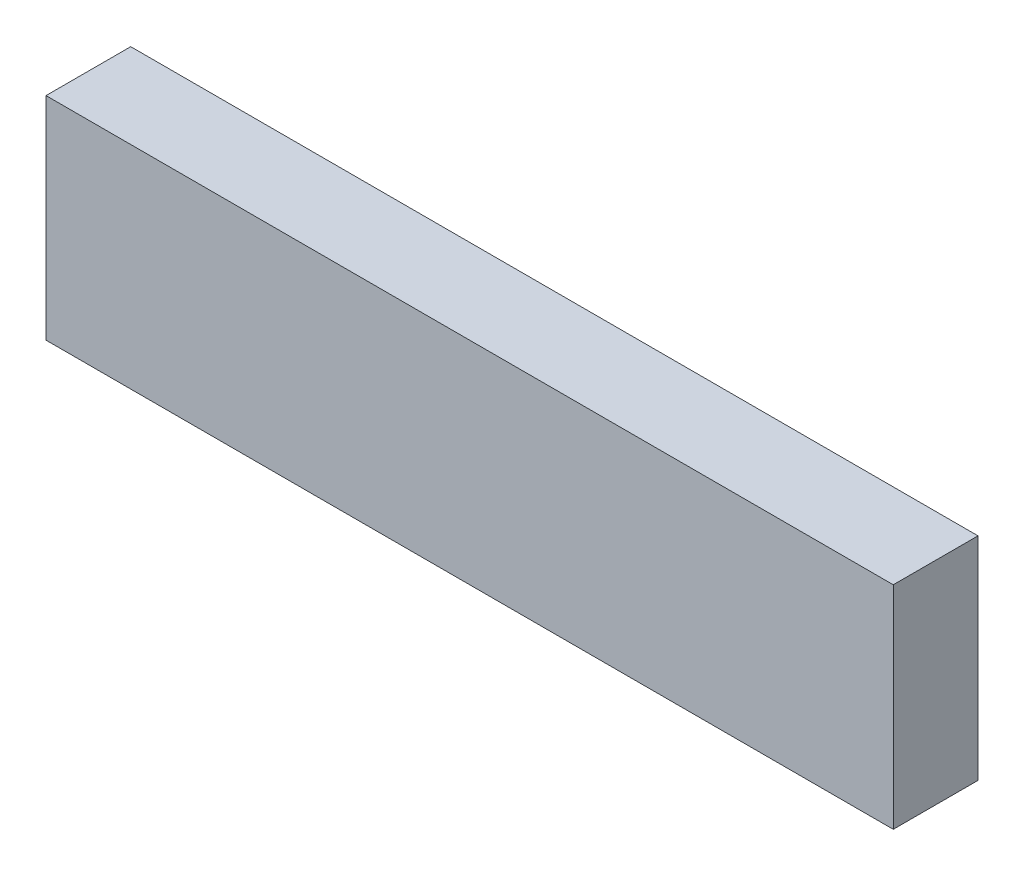
ISO-10303-21;
HEADER;
FILE_DESCRIPTION(('STEP AP214'),'2;1');
FILE_NAME('part.step','',(''),(''),'','','');
FILE_SCHEMA(('AUTOMOTIVE_DESIGN { 1 0 10303 214 1 1 1 1 }'));
ENDSEC;
DATA;
#1=APPLICATION_CONTEXT('core data for automotive mechanical design processes');
#2=APPLICATION_PROTOCOL_DEFINITION('international standard','automotive_design',2000,#1);
#3=PRODUCT_CONTEXT('',#1,'mechanical');
#4=PRODUCT('Part','Part','',(#3));
#5=PRODUCT_RELATED_PRODUCT_CATEGORY('part','',(#4));
#6=PRODUCT_DEFINITION_FORMATION('','',#4);
#7=PRODUCT_DEFINITION_CONTEXT('part definition',#1,'design');
#8=PRODUCT_DEFINITION('design','',#6,#7);
#9=PRODUCT_DEFINITION_SHAPE('','',#8);
#10=(LENGTH_UNIT() NAMED_UNIT(*) SI_UNIT(.MILLI.,.METRE.));
#11=(NAMED_UNIT(*) PLANE_ANGLE_UNIT() SI_UNIT($,.RADIAN.));
#12=(NAMED_UNIT(*) SI_UNIT($,.STERADIAN.) SOLID_ANGLE_UNIT());
#13=UNCERTAINTY_MEASURE_WITH_UNIT(LENGTH_MEASURE(1.E-05),#10,'distance_accuracy_value','');
#14=(GEOMETRIC_REPRESENTATION_CONTEXT(3) GLOBAL_UNCERTAINTY_ASSIGNED_CONTEXT((#13)) GLOBAL_UNIT_ASSIGNED_CONTEXT((#10,
#11,#12)) REPRESENTATION_CONTEXT('',''));
#15=CARTESIAN_POINT('',(0.,0.,0.));
#16=DIRECTION('',(0.,0.,1.));
#17=DIRECTION('',(1.,0.,0.));
#18=AXIS2_PLACEMENT_3D('',#15,#16,#17);
#19=CARTESIAN_POINT('',(198.,46.99,55.8));
#20=DIRECTION('',(0.,0.,-1.));
#21=DIRECTION('',(-1.,0.,0.));
#22=AXIS2_PLACEMENT_3D('',#19,#20,#21);
#23=PLANE('',#22);
#24=DIRECTION('',(0.,1.,0.));
#25=VECTOR('',#24,1.);
#26=CARTESIAN_POINT('',(210.,46.99,55.8));
#27=LINE('',#26,#25);
#28=CARTESIAN_POINT('',(210.,47.,55.8));
#29=VERTEX_POINT('',#28);
#30=CARTESIAN_POINT('',(210.,50.,55.8));
#31=VERTEX_POINT('',#30);
#32=EDGE_CURVE('E11',#29,#31,#27,.T.);
#33=ORIENTED_EDGE('',*,*,#32,.F.);
#34=DIRECTION('',(-1.,0.,0.));
#35=VECTOR('',#34,1.);
#36=CARTESIAN_POINT('',(300.,47.,55.8));
#37=LINE('',#36,#35);
#38=CARTESIAN_POINT('',(198.,47.,55.8));
#39=VERTEX_POINT('',#38);
#40=EDGE_CURVE('E39',#29,#39,#37,.T.);
#41=ORIENTED_EDGE('',*,*,#40,.T.);
#42=DIRECTION('',(0.,1.,0.));
#43=VECTOR('',#42,1.);
#44=CARTESIAN_POINT('',(198.,46.99,55.8));
#45=LINE('',#44,#43);
#46=CARTESIAN_POINT('',(198.,50.,55.8));
#47=VERTEX_POINT('',#46);
#48=EDGE_CURVE('E44',#39,#47,#45,.T.);
#49=ORIENTED_EDGE('',*,*,#48,.T.);
#50=DIRECTION('',(1.,0.,0.));
#51=VECTOR('',#50,1.);
#52=CARTESIAN_POINT('',(-300.,50.,55.8));
#53=LINE('',#52,#51);
#54=EDGE_CURVE('E94',#47,#31,#53,.T.);
#55=ORIENTED_EDGE('',*,*,#54,.T.);
#56=EDGE_LOOP('',(#33,#41,#49,#55));
#57=FACE_BOUND('',#56,.T.);
#58=ADVANCED_FACE('F35',(#57),#23,.T.);
#59=CARTESIAN_POINT('',(210.,46.99,55.8));
#60=DIRECTION('',(1.,0.,0.));
#61=DIRECTION('',(0.,0.,-1.));
#62=AXIS2_PLACEMENT_3D('',#59,#60,#61);
#63=PLANE('',#62);
#64=DIRECTION('',(0.,1.,0.));
#65=VECTOR('',#64,1.);
#66=CARTESIAN_POINT('',(210.,46.99,57.));
#67=LINE('',#66,#65);
#68=CARTESIAN_POINT('',(210.,47.,57.));
#69=VERTEX_POINT('',#68);
#70=CARTESIAN_POINT('',(210.,50.,57.));
#71=VERTEX_POINT('',#70);
#72=EDGE_CURVE('E83',#69,#71,#67,.T.);
#73=ORIENTED_EDGE('',*,*,#72,.F.);
#74=DIRECTION('',(0.,0.,-1.));
#75=VECTOR('',#74,1.);
#76=CARTESIAN_POINT('',(210.,47.,3.));
#77=LINE('',#76,#75);
#78=EDGE_CURVE('E102',#69,#29,#77,.T.);
#79=ORIENTED_EDGE('',*,*,#78,.T.);
#80=ORIENTED_EDGE('',*,*,#32,.T.);
#81=DIRECTION('',(0.,0.,1.));
#82=VECTOR('',#81,1.);
#83=CARTESIAN_POINT('',(210.,50.,60.));
#84=LINE('',#83,#82);
#85=EDGE_CURVE('E91',#31,#71,#84,.T.);
#86=ORIENTED_EDGE('',*,*,#85,.T.);
#87=EDGE_LOOP('',(#73,#79,#80,#86));
#88=FACE_BOUND('',#87,.T.);
#89=ADVANCED_FACE('F114',(#88),#63,.T.);
#90=CARTESIAN_POINT('',(198.,46.99,55.8));
#91=DIRECTION('',(-1.,0.,0.));
#92=DIRECTION('',(0.,0.,1.));
#93=AXIS2_PLACEMENT_3D('',#90,#91,#92);
#94=PLANE('',#93);
#95=ORIENTED_EDGE('',*,*,#48,.F.);
#96=DIRECTION('',(0.,0.,1.));
#97=VECTOR('',#96,1.);
#98=CARTESIAN_POINT('',(198.,47.,3.));
#99=LINE('',#98,#97);
#100=CARTESIAN_POINT('',(198.,47.,57.));
#101=VERTEX_POINT('',#100);
#102=EDGE_CURVE('E79',#39,#101,#99,.T.);
#103=ORIENTED_EDGE('',*,*,#102,.T.);
#104=DIRECTION('',(0.,1.,0.));
#105=VECTOR('',#104,1.);
#106=CARTESIAN_POINT('',(198.,46.99,57.));
#107=LINE('',#106,#105);
#108=CARTESIAN_POINT('',(198.,50.,57.));
#109=VERTEX_POINT('',#108);
#110=EDGE_CURVE('E73',#101,#109,#107,.T.);
#111=ORIENTED_EDGE('',*,*,#110,.T.);
#112=DIRECTION('',(0.,0.,-1.));
#113=VECTOR('',#112,1.);
#114=CARTESIAN_POINT('',(198.,50.,60.));
#115=LINE('',#114,#113);
#116=EDGE_CURVE('E77',#109,#47,#115,.T.);
#117=ORIENTED_EDGE('',*,*,#116,.T.);
#118=EDGE_LOOP('',(#95,#103,#111,#117));
#119=FACE_BOUND('',#118,.T.);
#120=ADVANCED_FACE('F75',(#119),#94,.T.);
#121=CARTESIAN_POINT('',(198.,46.99,57.));
#122=DIRECTION('',(0.,0.,1.));
#123=DIRECTION('',(1.,0.,0.));
#124=AXIS2_PLACEMENT_3D('',#121,#122,#123);
#125=PLANE('',#124);
#126=ORIENTED_EDGE('',*,*,#110,.F.);
#127=DIRECTION('',(1.,0.,0.));
#128=VECTOR('',#127,1.);
#129=CARTESIAN_POINT('',(300.,47.,57.));
#130=LINE('',#129,#128);
#131=EDGE_CURVE('E101',#101,#69,#130,.T.);
#132=ORIENTED_EDGE('',*,*,#131,.T.);
#133=ORIENTED_EDGE('',*,*,#72,.T.);
#134=DIRECTION('',(-1.,0.,0.));
#135=VECTOR('',#134,1.);
#136=CARTESIAN_POINT('',(-300.,50.,57.));
#137=LINE('',#136,#135);
#138=EDGE_CURVE('E86',#71,#109,#137,.T.);
#139=ORIENTED_EDGE('',*,*,#138,.T.);
#140=EDGE_LOOP('',(#126,#132,#133,#139));
#141=FACE_BOUND('',#140,.T.);
#142=ADVANCED_FACE('F87',(#141),#125,.T.);
#143=CARTESIAN_POINT('',(300.,47.,3.));
#144=DIRECTION('',(0.,1.,0.));
#145=DIRECTION('',(0.,0.,1.));
#146=AXIS2_PLACEMENT_3D('',#143,#144,#145);
#147=PLANE('',#146);
#148=ORIENTED_EDGE('',*,*,#102,.F.);
#149=ORIENTED_EDGE('',*,*,#40,.F.);
#150=ORIENTED_EDGE('',*,*,#78,.F.);
#151=ORIENTED_EDGE('',*,*,#131,.F.);
#152=EDGE_LOOP('',(#148,#149,#150,#151));
#153=FACE_BOUND('',#152,.T.);
#154=ADVANCED_FACE('F107',(#153),#147,.F.);
#155=CARTESIAN_POINT('',(-300.,50.,60.));
#156=DIRECTION('',(0.,-1.,0.));
#157=DIRECTION('',(0.,0.,-1.));
#158=AXIS2_PLACEMENT_3D('',#155,#156,#157);
#159=PLANE('',#158);
#160=ORIENTED_EDGE('',*,*,#116,.F.);
#161=ORIENTED_EDGE('',*,*,#138,.F.);
#162=ORIENTED_EDGE('',*,*,#85,.F.);
#163=ORIENTED_EDGE('',*,*,#54,.F.);
#164=EDGE_LOOP('',(#160,#161,#162,#163));
#165=FACE_BOUND('',#164,.T.);
#166=ADVANCED_FACE('F37',(#165),#159,.F.);
#167=CLOSED_SHELL('',(#58,#89,#120,#142,#154,#166));
#168=MANIFOLD_SOLID_BREP('B2',#167);
#169=ADVANCED_BREP_SHAPE_REPRESENTATION('',(#18,#168),#14);
#170=SHAPE_DEFINITION_REPRESENTATION(#9,#169);
ENDSEC;
END-ISO-10303-21;
